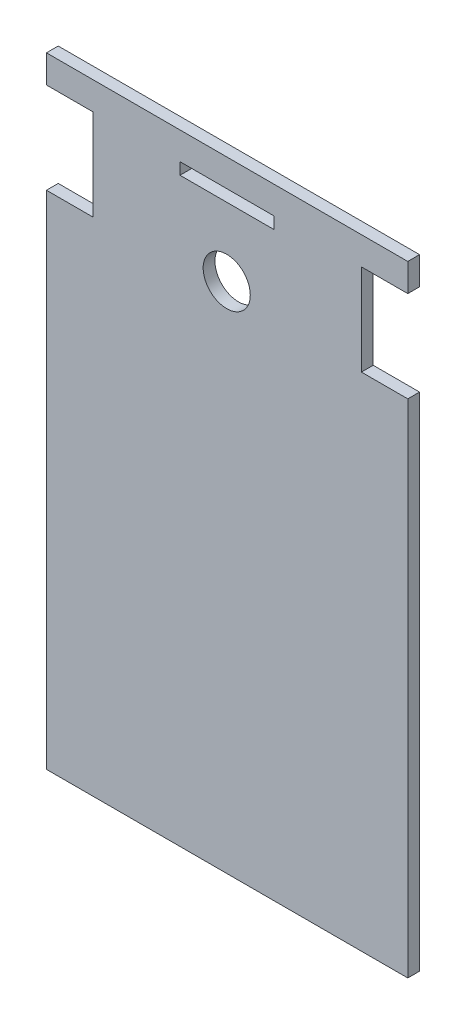
ISO-10303-21;
HEADER;
FILE_DESCRIPTION(('STEP AP214'),'2;1');
FILE_NAME('part.step','',(''),(''),'','','');
FILE_SCHEMA(('AUTOMOTIVE_DESIGN { 1 0 10303 214 1 1 1 1 }'));
ENDSEC;
DATA;
#1=APPLICATION_CONTEXT('core data for automotive mechanical design processes');
#2=APPLICATION_PROTOCOL_DEFINITION('international standard','automotive_design',2000,#1);
#3=PRODUCT_CONTEXT('',#1,'mechanical');
#4=PRODUCT('Part','Part','',(#3));
#5=PRODUCT_RELATED_PRODUCT_CATEGORY('part','',(#4));
#6=PRODUCT_DEFINITION_FORMATION('','',#4);
#7=PRODUCT_DEFINITION_CONTEXT('part definition',#1,'design');
#8=PRODUCT_DEFINITION('design','',#6,#7);
#9=PRODUCT_DEFINITION_SHAPE('','',#8);
#10=(LENGTH_UNIT() NAMED_UNIT(*) SI_UNIT(.MILLI.,.METRE.));
#11=(NAMED_UNIT(*) PLANE_ANGLE_UNIT() SI_UNIT($,.RADIAN.));
#12=(NAMED_UNIT(*) SI_UNIT($,.STERADIAN.) SOLID_ANGLE_UNIT());
#13=UNCERTAINTY_MEASURE_WITH_UNIT(LENGTH_MEASURE(1.E-05),#10,'distance_accuracy_value','');
#14=(GEOMETRIC_REPRESENTATION_CONTEXT(3) GLOBAL_UNCERTAINTY_ASSIGNED_CONTEXT((#13)) GLOBAL_UNIT_ASSIGNED_CONTEXT((#10,
#11,#12)) REPRESENTATION_CONTEXT('',''));
#15=CARTESIAN_POINT('',(0.,0.,0.));
#16=DIRECTION('',(0.,0.,1.));
#17=DIRECTION('',(1.,0.,0.));
#18=AXIS2_PLACEMENT_3D('',#15,#16,#17);
#19=CARTESIAN_POINT('',(0.,0.,3.));
#20=DIRECTION('',(0.,0.,1.));
#21=DIRECTION('',(1.,0.,0.));
#22=AXIS2_PLACEMENT_3D('',#19,#20,#21);
#23=PLANE('',#22);
#24=DIRECTION('',(-1.,0.,0.));
#25=VECTOR('',#24,1.);
#26=CARTESIAN_POINT('',(146.,89.,3.));
#27=LINE('',#26,#25);
#28=CARTESIAN_POINT('',(146.,89.,3.));
#29=VERTEX_POINT('',#28);
#30=CARTESIAN_POINT('',(54.,89.,3.));
#31=VERTEX_POINT('',#30);
#32=EDGE_CURVE('E188',#29,#31,#27,.T.);
#33=ORIENTED_EDGE('',*,*,#32,.T.);
#34=DIRECTION('',(0.,-1.,0.));
#35=VECTOR('',#34,1.);
#36=CARTESIAN_POINT('',(54.,89.,3.));
#37=LINE('',#36,#35);
#38=CARTESIAN_POINT('',(54.,81.9,3.));
#39=VERTEX_POINT('',#38);
#40=EDGE_CURVE('E191',#31,#39,#37,.T.);
#41=ORIENTED_EDGE('',*,*,#40,.T.);
#42=DIRECTION('',(1.,0.,0.));
#43=VECTOR('',#42,1.);
#44=CARTESIAN_POINT('',(54.,81.9,3.));
#45=LINE('',#44,#43);
#46=CARTESIAN_POINT('',(65.8,81.9,3.));
#47=VERTEX_POINT('',#46);
#48=EDGE_CURVE('E194',#39,#47,#45,.T.);
#49=ORIENTED_EDGE('',*,*,#48,.T.);
#50=DIRECTION('',(0.,-1.,0.));
#51=VECTOR('',#50,1.);
#52=CARTESIAN_POINT('',(65.8,81.9,3.));
#53=LINE('',#52,#51);
#54=CARTESIAN_POINT('',(65.8,58.7,3.));
#55=VERTEX_POINT('',#54);
#56=EDGE_CURVE('E196',#47,#55,#53,.T.);
#57=ORIENTED_EDGE('',*,*,#56,.T.);
#58=DIRECTION('',(-1.,0.,0.));
#59=VECTOR('',#58,1.);
#60=CARTESIAN_POINT('',(65.8,58.7,3.));
#61=LINE('',#60,#59);
#62=CARTESIAN_POINT('',(54.,58.7,3.));
#63=VERTEX_POINT('',#62);
#64=EDGE_CURVE('E198',#55,#63,#61,.T.);
#65=ORIENTED_EDGE('',*,*,#64,.T.);
#66=DIRECTION('',(0.,-1.,0.));
#67=VECTOR('',#66,1.);
#68=CARTESIAN_POINT('',(54.,58.7,3.));
#69=LINE('',#68,#67);
#70=CARTESIAN_POINT('',(54.,-69.,3.));
#71=VERTEX_POINT('',#70);
#72=EDGE_CURVE('E200',#63,#71,#69,.T.);
#73=ORIENTED_EDGE('',*,*,#72,.T.);
#74=DIRECTION('',(1.,0.,0.));
#75=VECTOR('',#74,1.);
#76=CARTESIAN_POINT('',(54.,-69.,3.));
#77=LINE('',#76,#75);
#78=CARTESIAN_POINT('',(146.,-69.,3.));
#79=VERTEX_POINT('',#78);
#80=EDGE_CURVE('E202',#71,#79,#77,.T.);
#81=ORIENTED_EDGE('',*,*,#80,.T.);
#82=DIRECTION('',(0.,1.,0.));
#83=VECTOR('',#82,1.);
#84=CARTESIAN_POINT('',(146.,-69.,3.));
#85=LINE('',#84,#83);
#86=CARTESIAN_POINT('',(146.,58.7,3.));
#87=VERTEX_POINT('',#86);
#88=EDGE_CURVE('E204',#79,#87,#85,.T.);
#89=ORIENTED_EDGE('',*,*,#88,.T.);
#90=DIRECTION('',(-1.,0.,0.));
#91=VECTOR('',#90,1.);
#92=CARTESIAN_POINT('',(146.,58.7,3.));
#93=LINE('',#92,#91);
#94=CARTESIAN_POINT('',(134.2,58.7,3.));
#95=VERTEX_POINT('',#94);
#96=EDGE_CURVE('E206',#87,#95,#93,.T.);
#97=ORIENTED_EDGE('',*,*,#96,.T.);
#98=DIRECTION('',(0.,1.,0.));
#99=VECTOR('',#98,1.);
#100=CARTESIAN_POINT('',(134.2,58.7,3.));
#101=LINE('',#100,#99);
#102=CARTESIAN_POINT('',(134.2,81.9,3.));
#103=VERTEX_POINT('',#102);
#104=EDGE_CURVE('E208',#95,#103,#101,.T.);
#105=ORIENTED_EDGE('',*,*,#104,.T.);
#106=DIRECTION('',(1.,0.,0.));
#107=VECTOR('',#106,1.);
#108=CARTESIAN_POINT('',(134.2,81.9,3.));
#109=LINE('',#108,#107);
#110=CARTESIAN_POINT('',(146.,81.8999999999998,3.));
#111=VERTEX_POINT('',#110);
#112=EDGE_CURVE('E210',#103,#111,#109,.T.);
#113=ORIENTED_EDGE('',*,*,#112,.T.);
#114=DIRECTION('',(0.,1.,0.));
#115=VECTOR('',#114,1.);
#116=CARTESIAN_POINT('',(146.,81.8999999999998,3.));
#117=LINE('',#116,#115);
#118=EDGE_CURVE('E212',#111,#29,#117,.T.);
#119=ORIENTED_EDGE('',*,*,#118,.T.);
#120=EDGE_LOOP('',(#33,#41,#49,#57,#65,#73,#81,#89,#97,#105,#113,#119));
#121=FACE_BOUND('',#120,.T.);
#122=CARTESIAN_POINT('',(99.8993042330256,61.5295629921831,3.));
#123=DIRECTION('',(0.,0.,1.));
#124=DIRECTION('',(1.,0.,0.));
#125=AXIS2_PLACEMENT_3D('',#122,#123,#124);
#126=CIRCLE('',#125,6.00000000000001);
#127=CARTESIAN_POINT('',(105.899304233026,61.5295629921831,3.));
#128=VERTEX_POINT('',#127);
#129=EDGE_CURVE('E182',#128,#128,#126,.T.);
#130=ORIENTED_EDGE('',*,*,#129,.F.);
#131=EDGE_LOOP('',(#130));
#132=FACE_BOUND('',#131,.T.);
#133=DIRECTION('',(1.,0.,0.));
#134=VECTOR('',#133,1.);
#135=CARTESIAN_POINT('',(88.,79.,3.));
#136=LINE('',#135,#134);
#137=CARTESIAN_POINT('',(88.,79.,3.));
#138=VERTEX_POINT('',#137);
#139=CARTESIAN_POINT('',(112.,79.,3.));
#140=VERTEX_POINT('',#139);
#141=EDGE_CURVE('E154',#138,#140,#136,.T.);
#142=ORIENTED_EDGE('',*,*,#141,.F.);
#143=DIRECTION('',(0.,-1.,0.));
#144=VECTOR('',#143,1.);
#145=CARTESIAN_POINT('',(88.,82.,3.));
#146=LINE('',#145,#144);
#147=CARTESIAN_POINT('',(88.,82.,3.));
#148=VERTEX_POINT('',#147);
#149=EDGE_CURVE('E146',#148,#138,#146,.T.);
#150=ORIENTED_EDGE('',*,*,#149,.F.);
#151=DIRECTION('',(-1.,0.,0.));
#152=VECTOR('',#151,1.);
#153=CARTESIAN_POINT('',(112.,82.,3.));
#154=LINE('',#153,#152);
#155=CARTESIAN_POINT('',(112.,82.,3.));
#156=VERTEX_POINT('',#155);
#157=EDGE_CURVE('E168',#156,#148,#154,.T.);
#158=ORIENTED_EDGE('',*,*,#157,.F.);
#159=DIRECTION('',(0.,1.,0.));
#160=VECTOR('',#159,1.);
#161=CARTESIAN_POINT('',(112.,79.,3.));
#162=LINE('',#161,#160);
#163=EDGE_CURVE('E166',#140,#156,#162,.T.);
#164=ORIENTED_EDGE('',*,*,#163,.F.);
#165=EDGE_LOOP('',(#142,#150,#158,#164));
#166=FACE_BOUND('',#165,.T.);
#167=ADVANCED_FACE('F33',(#121,#132,#166),#23,.T.);
#168=CARTESIAN_POINT('',(0.,0.,0.));
#169=DIRECTION('',(0.,0.,1.));
#170=DIRECTION('',(1.,0.,0.));
#171=AXIS2_PLACEMENT_3D('',#168,#169,#170);
#172=PLANE('',#171);
#173=CARTESIAN_POINT('',(99.8993042330256,61.5295629921831,0.));
#174=DIRECTION('',(0.,0.,1.));
#175=DIRECTION('',(1.,0.,0.));
#176=AXIS2_PLACEMENT_3D('',#173,#174,#175);
#177=CIRCLE('',#176,6.00000000000001);
#178=CARTESIAN_POINT('',(105.899304233026,61.5295629921831,0.));
#179=VERTEX_POINT('',#178);
#180=EDGE_CURVE('E162',#179,#179,#177,.T.);
#181=ORIENTED_EDGE('',*,*,#180,.T.);
#182=EDGE_LOOP('',(#181));
#183=FACE_BOUND('',#182,.T.);
#184=DIRECTION('',(-1.,0.,0.));
#185=VECTOR('',#184,1.);
#186=CARTESIAN_POINT('',(146.,89.,0.));
#187=LINE('',#186,#185);
#188=CARTESIAN_POINT('',(146.,89.,0.));
#189=VERTEX_POINT('',#188);
#190=CARTESIAN_POINT('',(54.,89.,0.));
#191=VERTEX_POINT('',#190);
#192=EDGE_CURVE('E185',#189,#191,#187,.T.);
#193=ORIENTED_EDGE('',*,*,#192,.F.);
#194=DIRECTION('',(0.,1.,0.));
#195=VECTOR('',#194,1.);
#196=CARTESIAN_POINT('',(146.,81.8999999999998,0.));
#197=LINE('',#196,#195);
#198=CARTESIAN_POINT('',(146.,81.8999999999998,0.));
#199=VERTEX_POINT('',#198);
#200=EDGE_CURVE('E192',#199,#189,#197,.T.);
#201=ORIENTED_EDGE('',*,*,#200,.F.);
#202=DIRECTION('',(1.,0.,0.));
#203=VECTOR('',#202,1.);
#204=CARTESIAN_POINT('',(134.2,81.9,0.));
#205=LINE('',#204,#203);
#206=CARTESIAN_POINT('',(134.2,81.9,0.));
#207=VERTEX_POINT('',#206);
#208=EDGE_CURVE('E235',#207,#199,#205,.T.);
#209=ORIENTED_EDGE('',*,*,#208,.F.);
#210=DIRECTION('',(0.,1.,0.));
#211=VECTOR('',#210,1.);
#212=CARTESIAN_POINT('',(134.2,58.7,0.));
#213=LINE('',#212,#211);
#214=CARTESIAN_POINT('',(134.2,58.7,0.));
#215=VERTEX_POINT('',#214);
#216=EDGE_CURVE('E233',#215,#207,#213,.T.);
#217=ORIENTED_EDGE('',*,*,#216,.F.);
#218=DIRECTION('',(-1.,0.,0.));
#219=VECTOR('',#218,1.);
#220=CARTESIAN_POINT('',(146.,58.7,0.));
#221=LINE('',#220,#219);
#222=CARTESIAN_POINT('',(146.,58.7,0.));
#223=VERTEX_POINT('',#222);
#224=EDGE_CURVE('E231',#223,#215,#221,.T.);
#225=ORIENTED_EDGE('',*,*,#224,.F.);
#226=DIRECTION('',(0.,1.,0.));
#227=VECTOR('',#226,1.);
#228=CARTESIAN_POINT('',(146.,-69.,0.));
#229=LINE('',#228,#227);
#230=CARTESIAN_POINT('',(146.,-69.,0.));
#231=VERTEX_POINT('',#230);
#232=EDGE_CURVE('E229',#231,#223,#229,.T.);
#233=ORIENTED_EDGE('',*,*,#232,.F.);
#234=DIRECTION('',(1.,0.,0.));
#235=VECTOR('',#234,1.);
#236=CARTESIAN_POINT('',(54.,-69.,0.));
#237=LINE('',#236,#235);
#238=CARTESIAN_POINT('',(54.,-69.,0.));
#239=VERTEX_POINT('',#238);
#240=EDGE_CURVE('E227',#239,#231,#237,.T.);
#241=ORIENTED_EDGE('',*,*,#240,.F.);
#242=DIRECTION('',(0.,-1.,0.));
#243=VECTOR('',#242,1.);
#244=CARTESIAN_POINT('',(54.,58.7,0.));
#245=LINE('',#244,#243);
#246=CARTESIAN_POINT('',(54.,58.7,0.));
#247=VERTEX_POINT('',#246);
#248=EDGE_CURVE('E225',#247,#239,#245,.T.);
#249=ORIENTED_EDGE('',*,*,#248,.F.);
#250=DIRECTION('',(-1.,0.,0.));
#251=VECTOR('',#250,1.);
#252=CARTESIAN_POINT('',(65.8,58.7,0.));
#253=LINE('',#252,#251);
#254=CARTESIAN_POINT('',(65.8,58.7,0.));
#255=VERTEX_POINT('',#254);
#256=EDGE_CURVE('E223',#255,#247,#253,.T.);
#257=ORIENTED_EDGE('',*,*,#256,.F.);
#258=DIRECTION('',(0.,-1.,0.));
#259=VECTOR('',#258,1.);
#260=CARTESIAN_POINT('',(65.8,81.9,0.));
#261=LINE('',#260,#259);
#262=CARTESIAN_POINT('',(65.8,81.9,0.));
#263=VERTEX_POINT('',#262);
#264=EDGE_CURVE('E221',#263,#255,#261,.T.);
#265=ORIENTED_EDGE('',*,*,#264,.F.);
#266=DIRECTION('',(1.,0.,0.));
#267=VECTOR('',#266,1.);
#268=CARTESIAN_POINT('',(54.,81.9,0.));
#269=LINE('',#268,#267);
#270=CARTESIAN_POINT('',(54.,81.9,0.));
#271=VERTEX_POINT('',#270);
#272=EDGE_CURVE('E219',#271,#263,#269,.T.);
#273=ORIENTED_EDGE('',*,*,#272,.F.);
#274=DIRECTION('',(0.,-1.,0.));
#275=VECTOR('',#274,1.);
#276=CARTESIAN_POINT('',(54.,89.,0.));
#277=LINE('',#276,#275);
#278=EDGE_CURVE('E217',#191,#271,#277,.T.);
#279=ORIENTED_EDGE('',*,*,#278,.F.);
#280=EDGE_LOOP('',(#193,#201,#209,#217,#225,#233,#241,#249,#257,#265,#273,#279));
#281=FACE_BOUND('',#280,.T.);
#282=DIRECTION('',(0.,-1.,0.));
#283=VECTOR('',#282,1.);
#284=CARTESIAN_POINT('',(88.,82.,0.));
#285=LINE('',#284,#283);
#286=CARTESIAN_POINT('',(88.,82.,0.));
#287=VERTEX_POINT('',#286);
#288=CARTESIAN_POINT('',(88.,79.,0.));
#289=VERTEX_POINT('',#288);
#290=EDGE_CURVE('E56',#287,#289,#285,.T.);
#291=ORIENTED_EDGE('',*,*,#290,.T.);
#292=DIRECTION('',(1.,0.,0.));
#293=VECTOR('',#292,1.);
#294=CARTESIAN_POINT('',(88.,79.,0.));
#295=LINE('',#294,#293);
#296=CARTESIAN_POINT('',(112.,79.,0.));
#297=VERTEX_POINT('',#296);
#298=EDGE_CURVE('E161',#289,#297,#295,.T.);
#299=ORIENTED_EDGE('',*,*,#298,.T.);
#300=DIRECTION('',(0.,1.,0.));
#301=VECTOR('',#300,1.);
#302=CARTESIAN_POINT('',(112.,79.,0.));
#303=LINE('',#302,#301);
#304=CARTESIAN_POINT('',(112.,82.,0.));
#305=VERTEX_POINT('',#304);
#306=EDGE_CURVE('E174',#297,#305,#303,.T.);
#307=ORIENTED_EDGE('',*,*,#306,.T.);
#308=DIRECTION('',(-1.,0.,0.));
#309=VECTOR('',#308,1.);
#310=CARTESIAN_POINT('',(112.,82.,0.));
#311=LINE('',#310,#309);
#312=EDGE_CURVE('E155',#305,#287,#311,.T.);
#313=ORIENTED_EDGE('',*,*,#312,.T.);
#314=EDGE_LOOP('',(#291,#299,#307,#313));
#315=FACE_BOUND('',#314,.T.);
#316=ADVANCED_FACE('F277',(#183,#281,#315),#172,.F.);
#317=CARTESIAN_POINT('',(146.,89.,3.));
#318=DIRECTION('',(0.,-1.,0.));
#319=DIRECTION('',(0.,0.,-1.));
#320=AXIS2_PLACEMENT_3D('',#317,#318,#319);
#321=PLANE('',#320);
#322=ORIENTED_EDGE('',*,*,#192,.T.);
#323=DIRECTION('',(0.,0.,-1.));
#324=VECTOR('',#323,1.);
#325=CARTESIAN_POINT('',(54.,89.,3.));
#326=LINE('',#325,#324);
#327=EDGE_CURVE('E11',#31,#191,#326,.T.);
#328=ORIENTED_EDGE('',*,*,#327,.F.);
#329=ORIENTED_EDGE('',*,*,#32,.F.);
#330=DIRECTION('',(0.,0.,-1.));
#331=VECTOR('',#330,1.);
#332=CARTESIAN_POINT('',(146.,89.,3.));
#333=LINE('',#332,#331);
#334=EDGE_CURVE('E214',#29,#189,#333,.T.);
#335=ORIENTED_EDGE('',*,*,#334,.T.);
#336=EDGE_LOOP('',(#322,#328,#329,#335));
#337=FACE_BOUND('',#336,.T.);
#338=ADVANCED_FACE('F35',(#337),#321,.F.);
#339=CARTESIAN_POINT('',(54.,89.,3.));
#340=DIRECTION('',(1.,0.,0.));
#341=DIRECTION('',(0.,0.,-1.));
#342=AXIS2_PLACEMENT_3D('',#339,#340,#341);
#343=PLANE('',#342);
#344=ORIENTED_EDGE('',*,*,#278,.T.);
#345=DIRECTION('',(0.,0.,-1.));
#346=VECTOR('',#345,1.);
#347=CARTESIAN_POINT('',(54.,81.9,3.));
#348=LINE('',#347,#346);
#349=EDGE_CURVE('E41',#39,#271,#348,.T.);
#350=ORIENTED_EDGE('',*,*,#349,.F.);
#351=ORIENTED_EDGE('',*,*,#40,.F.);
#352=ORIENTED_EDGE('',*,*,#327,.T.);
#353=EDGE_LOOP('',(#344,#350,#351,#352));
#354=FACE_BOUND('',#353,.T.);
#355=ADVANCED_FACE('F295',(#354),#343,.F.);
#356=CARTESIAN_POINT('',(54.,81.9,3.));
#357=DIRECTION('',(0.,1.,0.));
#358=DIRECTION('',(0.,0.,1.));
#359=AXIS2_PLACEMENT_3D('',#356,#357,#358);
#360=PLANE('',#359);
#361=ORIENTED_EDGE('',*,*,#272,.T.);
#362=DIRECTION('',(0.,0.,-1.));
#363=VECTOR('',#362,1.);
#364=CARTESIAN_POINT('',(65.8,81.9,3.));
#365=LINE('',#364,#363);
#366=EDGE_CURVE('E264',#47,#263,#365,.T.);
#367=ORIENTED_EDGE('',*,*,#366,.F.);
#368=ORIENTED_EDGE('',*,*,#48,.F.);
#369=ORIENTED_EDGE('',*,*,#349,.T.);
#370=EDGE_LOOP('',(#361,#367,#368,#369));
#371=FACE_BOUND('',#370,.T.);
#372=ADVANCED_FACE('F271',(#371),#360,.F.);
#373=CARTESIAN_POINT('',(65.8,81.9,3.));
#374=DIRECTION('',(1.,0.,0.));
#375=DIRECTION('',(0.,0.,-1.));
#376=AXIS2_PLACEMENT_3D('',#373,#374,#375);
#377=PLANE('',#376);
#378=ORIENTED_EDGE('',*,*,#264,.T.);
#379=DIRECTION('',(0.,0.,-1.));
#380=VECTOR('',#379,1.);
#381=CARTESIAN_POINT('',(65.8,58.7,3.));
#382=LINE('',#381,#380);
#383=EDGE_CURVE('E261',#55,#255,#382,.T.);
#384=ORIENTED_EDGE('',*,*,#383,.F.);
#385=ORIENTED_EDGE('',*,*,#56,.F.);
#386=ORIENTED_EDGE('',*,*,#366,.T.);
#387=EDGE_LOOP('',(#378,#384,#385,#386));
#388=FACE_BOUND('',#387,.T.);
#389=ADVANCED_FACE('F283',(#388),#377,.F.);
#390=CARTESIAN_POINT('',(65.8,58.7,3.));
#391=DIRECTION('',(0.,-1.,0.));
#392=DIRECTION('',(0.,0.,-1.));
#393=AXIS2_PLACEMENT_3D('',#390,#391,#392);
#394=PLANE('',#393);
#395=ORIENTED_EDGE('',*,*,#256,.T.);
#396=DIRECTION('',(0.,0.,-1.));
#397=VECTOR('',#396,1.);
#398=CARTESIAN_POINT('',(54.,58.7,3.));
#399=LINE('',#398,#397);
#400=EDGE_CURVE('E258',#63,#247,#399,.T.);
#401=ORIENTED_EDGE('',*,*,#400,.F.);
#402=ORIENTED_EDGE('',*,*,#64,.F.);
#403=ORIENTED_EDGE('',*,*,#383,.T.);
#404=EDGE_LOOP('',(#395,#401,#402,#403));
#405=FACE_BOUND('',#404,.T.);
#406=ADVANCED_FACE('F287',(#405),#394,.F.);
#407=CARTESIAN_POINT('',(54.,58.7,3.));
#408=DIRECTION('',(1.,0.,0.));
#409=DIRECTION('',(0.,0.,-1.));
#410=AXIS2_PLACEMENT_3D('',#407,#408,#409);
#411=PLANE('',#410);
#412=ORIENTED_EDGE('',*,*,#248,.T.);
#413=DIRECTION('',(0.,0.,-1.));
#414=VECTOR('',#413,1.);
#415=CARTESIAN_POINT('',(54.,-69.,3.));
#416=LINE('',#415,#414);
#417=EDGE_CURVE('E255',#71,#239,#416,.T.);
#418=ORIENTED_EDGE('',*,*,#417,.F.);
#419=ORIENTED_EDGE('',*,*,#72,.F.);
#420=ORIENTED_EDGE('',*,*,#400,.T.);
#421=EDGE_LOOP('',(#412,#418,#419,#420));
#422=FACE_BOUND('',#421,.T.);
#423=ADVANCED_FACE('F328',(#422),#411,.F.);
#424=CARTESIAN_POINT('',(54.,-69.,3.));
#425=DIRECTION('',(0.,1.,0.));
#426=DIRECTION('',(0.,0.,1.));
#427=AXIS2_PLACEMENT_3D('',#424,#425,#426);
#428=PLANE('',#427);
#429=ORIENTED_EDGE('',*,*,#240,.T.);
#430=DIRECTION('',(0.,0.,-1.));
#431=VECTOR('',#430,1.);
#432=CARTESIAN_POINT('',(146.,-69.,3.));
#433=LINE('',#432,#431);
#434=EDGE_CURVE('E252',#79,#231,#433,.T.);
#435=ORIENTED_EDGE('',*,*,#434,.F.);
#436=ORIENTED_EDGE('',*,*,#80,.F.);
#437=ORIENTED_EDGE('',*,*,#417,.T.);
#438=EDGE_LOOP('',(#429,#435,#436,#437));
#439=FACE_BOUND('',#438,.T.);
#440=ADVANCED_FACE('F326',(#439),#428,.F.);
#441=CARTESIAN_POINT('',(146.,-69.,3.));
#442=DIRECTION('',(-1.,0.,0.));
#443=DIRECTION('',(0.,0.,1.));
#444=AXIS2_PLACEMENT_3D('',#441,#442,#443);
#445=PLANE('',#444);
#446=ORIENTED_EDGE('',*,*,#232,.T.);
#447=DIRECTION('',(0.,0.,-1.));
#448=VECTOR('',#447,1.);
#449=CARTESIAN_POINT('',(146.,58.7,3.));
#450=LINE('',#449,#448);
#451=EDGE_CURVE('E249',#87,#223,#450,.T.);
#452=ORIENTED_EDGE('',*,*,#451,.F.);
#453=ORIENTED_EDGE('',*,*,#88,.F.);
#454=ORIENTED_EDGE('',*,*,#434,.T.);
#455=EDGE_LOOP('',(#446,#452,#453,#454));
#456=FACE_BOUND('',#455,.T.);
#457=ADVANCED_FACE('F322',(#456),#445,.F.);
#458=CARTESIAN_POINT('',(146.,58.7,3.));
#459=DIRECTION('',(0.,-1.,0.));
#460=DIRECTION('',(0.,0.,-1.));
#461=AXIS2_PLACEMENT_3D('',#458,#459,#460);
#462=PLANE('',#461);
#463=ORIENTED_EDGE('',*,*,#224,.T.);
#464=DIRECTION('',(0.,0.,-1.));
#465=VECTOR('',#464,1.);
#466=CARTESIAN_POINT('',(134.2,58.7,3.));
#467=LINE('',#466,#465);
#468=EDGE_CURVE('E246',#95,#215,#467,.T.);
#469=ORIENTED_EDGE('',*,*,#468,.F.);
#470=ORIENTED_EDGE('',*,*,#96,.F.);
#471=ORIENTED_EDGE('',*,*,#451,.T.);
#472=EDGE_LOOP('',(#463,#469,#470,#471));
#473=FACE_BOUND('',#472,.T.);
#474=ADVANCED_FACE('F317',(#473),#462,.F.);
#475=CARTESIAN_POINT('',(134.2,58.7,3.));
#476=DIRECTION('',(-1.,0.,0.));
#477=DIRECTION('',(0.,0.,1.));
#478=AXIS2_PLACEMENT_3D('',#475,#476,#477);
#479=PLANE('',#478);
#480=ORIENTED_EDGE('',*,*,#216,.T.);
#481=DIRECTION('',(0.,0.,-1.));
#482=VECTOR('',#481,1.);
#483=CARTESIAN_POINT('',(134.2,81.9,3.));
#484=LINE('',#483,#482);
#485=EDGE_CURVE('E243',#103,#207,#484,.T.);
#486=ORIENTED_EDGE('',*,*,#485,.F.);
#487=ORIENTED_EDGE('',*,*,#104,.F.);
#488=ORIENTED_EDGE('',*,*,#468,.T.);
#489=EDGE_LOOP('',(#480,#486,#487,#488));
#490=FACE_BOUND('',#489,.T.);
#491=ADVANCED_FACE('F311',(#490),#479,.F.);
#492=CARTESIAN_POINT('',(134.2,81.9,3.));
#493=DIRECTION('',(0.,1.,0.));
#494=DIRECTION('',(-1.,0.,0.));
#495=AXIS2_PLACEMENT_3D('',#492,#493,#494);
#496=PLANE('',#495);
#497=ORIENTED_EDGE('',*,*,#208,.T.);
#498=DIRECTION('',(0.,0.,-1.));
#499=VECTOR('',#498,1.);
#500=CARTESIAN_POINT('',(146.,81.8999999999998,3.));
#501=LINE('',#500,#499);
#502=EDGE_CURVE('E240',#111,#199,#501,.T.);
#503=ORIENTED_EDGE('',*,*,#502,.F.);
#504=ORIENTED_EDGE('',*,*,#112,.F.);
#505=ORIENTED_EDGE('',*,*,#485,.T.);
#506=EDGE_LOOP('',(#497,#503,#504,#505));
#507=FACE_BOUND('',#506,.T.);
#508=ADVANCED_FACE('F307',(#507),#496,.F.);
#509=CARTESIAN_POINT('',(146.,81.8999999999998,3.));
#510=DIRECTION('',(-1.,0.,0.));
#511=DIRECTION('',(0.,0.,1.));
#512=AXIS2_PLACEMENT_3D('',#509,#510,#511);
#513=PLANE('',#512);
#514=ORIENTED_EDGE('',*,*,#200,.T.);
#515=ORIENTED_EDGE('',*,*,#334,.F.);
#516=ORIENTED_EDGE('',*,*,#118,.F.);
#517=ORIENTED_EDGE('',*,*,#502,.T.);
#518=EDGE_LOOP('',(#514,#515,#516,#517));
#519=FACE_BOUND('',#518,.T.);
#520=ADVANCED_FACE('F302',(#519),#513,.F.);
#521=CARTESIAN_POINT('',(99.8993042330256,61.5295629921831,3.));
#522=DIRECTION('',(0.,0.,-1.));
#523=DIRECTION('',(-1.,0.,0.));
#524=AXIS2_PLACEMENT_3D('',#521,#522,#523);
#525=CYLINDRICAL_SURFACE('',#524,6.00000000000001);
#526=ORIENTED_EDGE('',*,*,#129,.T.);
#527=EDGE_LOOP('',(#526));
#528=FACE_BOUND('',#527,.T.);
#529=ORIENTED_EDGE('',*,*,#180,.F.);
#530=EDGE_LOOP('',(#529));
#531=FACE_BOUND('',#530,.T.);
#532=ADVANCED_FACE('F345',(#528,#531),#525,.F.);
#533=CARTESIAN_POINT('',(88.,82.,3.));
#534=DIRECTION('',(1.,0.,0.));
#535=DIRECTION('',(0.,1.,0.));
#536=AXIS2_PLACEMENT_3D('',#533,#534,#535);
#537=PLANE('',#536);
#538=ORIENTED_EDGE('',*,*,#290,.F.);
#539=DIRECTION('',(0.,0.,-1.));
#540=VECTOR('',#539,1.);
#541=CARTESIAN_POINT('',(88.,82.,3.));
#542=LINE('',#541,#540);
#543=EDGE_CURVE('E150',#148,#287,#542,.T.);
#544=ORIENTED_EDGE('',*,*,#543,.F.);
#545=ORIENTED_EDGE('',*,*,#149,.T.);
#546=DIRECTION('',(0.,0.,-1.));
#547=VECTOR('',#546,1.);
#548=CARTESIAN_POINT('',(88.,79.,3.));
#549=LINE('',#548,#547);
#550=EDGE_CURVE('E149',#138,#289,#549,.T.);
#551=ORIENTED_EDGE('',*,*,#550,.T.);
#552=EDGE_LOOP('',(#538,#544,#545,#551));
#553=FACE_BOUND('',#552,.T.);
#554=ADVANCED_FACE('F148',(#553),#537,.T.);
#555=CARTESIAN_POINT('',(88.,79.,3.));
#556=DIRECTION('',(0.,1.,0.));
#557=DIRECTION('',(0.,0.,1.));
#558=AXIS2_PLACEMENT_3D('',#555,#556,#557);
#559=PLANE('',#558);
#560=ORIENTED_EDGE('',*,*,#298,.F.);
#561=ORIENTED_EDGE('',*,*,#550,.F.);
#562=ORIENTED_EDGE('',*,*,#141,.T.);
#563=DIRECTION('',(0.,0.,-1.));
#564=VECTOR('',#563,1.);
#565=CARTESIAN_POINT('',(112.,79.,3.));
#566=LINE('',#565,#564);
#567=EDGE_CURVE('E163',#140,#297,#566,.T.);
#568=ORIENTED_EDGE('',*,*,#567,.T.);
#569=EDGE_LOOP('',(#560,#561,#562,#568));
#570=FACE_BOUND('',#569,.T.);
#571=ADVANCED_FACE('F158',(#570),#559,.T.);
#572=CARTESIAN_POINT('',(112.,79.,3.));
#573=DIRECTION('',(-1.,0.,0.));
#574=DIRECTION('',(0.,0.,1.));
#575=AXIS2_PLACEMENT_3D('',#572,#573,#574);
#576=PLANE('',#575);
#577=ORIENTED_EDGE('',*,*,#306,.F.);
#578=ORIENTED_EDGE('',*,*,#567,.F.);
#579=ORIENTED_EDGE('',*,*,#163,.T.);
#580=DIRECTION('',(0.,0.,-1.));
#581=VECTOR('',#580,1.);
#582=CARTESIAN_POINT('',(112.,82.,3.));
#583=LINE('',#582,#581);
#584=EDGE_CURVE('E48',#156,#305,#583,.T.);
#585=ORIENTED_EDGE('',*,*,#584,.T.);
#586=EDGE_LOOP('',(#577,#578,#579,#585));
#587=FACE_BOUND('',#586,.T.);
#588=ADVANCED_FACE('F394',(#587),#576,.T.);
#589=CARTESIAN_POINT('',(112.,82.,3.));
#590=DIRECTION('',(0.,-1.,0.));
#591=DIRECTION('',(0.,0.,-1.));
#592=AXIS2_PLACEMENT_3D('',#589,#590,#591);
#593=PLANE('',#592);
#594=ORIENTED_EDGE('',*,*,#312,.F.);
#595=ORIENTED_EDGE('',*,*,#584,.F.);
#596=ORIENTED_EDGE('',*,*,#157,.T.);
#597=ORIENTED_EDGE('',*,*,#543,.T.);
#598=EDGE_LOOP('',(#594,#595,#596,#597));
#599=FACE_BOUND('',#598,.T.);
#600=ADVANCED_FACE('F401',(#599),#593,.T.);
#601=CLOSED_SHELL('',(#167,#316,#338,#355,#372,#389,#406,#423,#440,#457,#474,#491,#508,#520,
#532,#554,#571,#588,#600));
#602=MANIFOLD_SOLID_BREP('B2',#601);
#603=ADVANCED_BREP_SHAPE_REPRESENTATION('',(#18,#602),#14);
#604=SHAPE_DEFINITION_REPRESENTATION(#9,#603);
ENDSEC;
END-ISO-10303-21;
